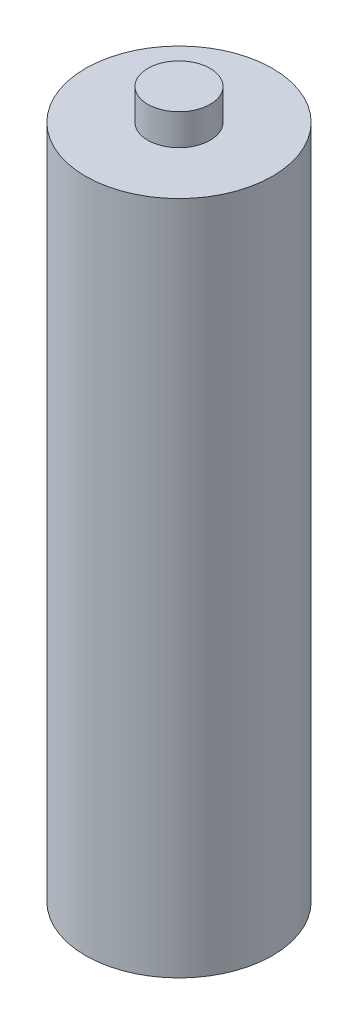
ISO-10303-21;
HEADER;
FILE_DESCRIPTION(('STEP AP214'),'2;1');
FILE_NAME('part.step','',(''),(''),'','','');
FILE_SCHEMA(('AUTOMOTIVE_DESIGN { 1 0 10303 214 1 1 1 1 }'));
ENDSEC;
DATA;
#1=APPLICATION_CONTEXT('core data for automotive mechanical design processes');
#2=APPLICATION_PROTOCOL_DEFINITION('international standard','automotive_design',2000,#1);
#3=PRODUCT_CONTEXT('',#1,'mechanical');
#4=PRODUCT('Part','Part','',(#3));
#5=PRODUCT_RELATED_PRODUCT_CATEGORY('part','',(#4));
#6=PRODUCT_DEFINITION_FORMATION('','',#4);
#7=PRODUCT_DEFINITION_CONTEXT('part definition',#1,'design');
#8=PRODUCT_DEFINITION('design','',#6,#7);
#9=PRODUCT_DEFINITION_SHAPE('','',#8);
#10=(LENGTH_UNIT() NAMED_UNIT(*) SI_UNIT(.MILLI.,.METRE.));
#11=(NAMED_UNIT(*) PLANE_ANGLE_UNIT() SI_UNIT($,.RADIAN.));
#12=(NAMED_UNIT(*) SI_UNIT($,.STERADIAN.) SOLID_ANGLE_UNIT());
#13=UNCERTAINTY_MEASURE_WITH_UNIT(LENGTH_MEASURE(1.E-05),#10,'distance_accuracy_value','');
#14=(GEOMETRIC_REPRESENTATION_CONTEXT(3) GLOBAL_UNCERTAINTY_ASSIGNED_CONTEXT((#13)) GLOBAL_UNIT_ASSIGNED_CONTEXT((#10,
#11,#12)) REPRESENTATION_CONTEXT('',''));
#15=CARTESIAN_POINT('',(0.,0.,0.));
#16=DIRECTION('',(0.,0.,1.));
#17=DIRECTION('',(1.,0.,0.));
#18=AXIS2_PLACEMENT_3D('',#15,#16,#17);
#19=CARTESIAN_POINT('',(0.,65.,0.));
#20=DIRECTION('',(0.,-1.,0.));
#21=DIRECTION('',(0.,0.,-1.));
#22=AXIS2_PLACEMENT_3D('',#19,#20,#21);
#23=CYLINDRICAL_SURFACE('',#22,9.);
#24=CARTESIAN_POINT('',(0.,65.,0.));
#25=DIRECTION('',(0.,1.,0.));
#26=DIRECTION('',(0.,0.,1.));
#27=AXIS2_PLACEMENT_3D('',#24,#25,#26);
#28=CIRCLE('',#27,9.);
#29=CARTESIAN_POINT('',(0.,65.,9.));
#30=VERTEX_POINT('',#29);
#31=EDGE_CURVE('E38',#30,#30,#28,.T.);
#32=ORIENTED_EDGE('',*,*,#31,.F.);
#33=EDGE_LOOP('',(#32));
#34=FACE_BOUND('',#33,.T.);
#35=CARTESIAN_POINT('',(0.,0.,0.));
#36=DIRECTION('',(0.,1.,0.));
#37=DIRECTION('',(0.,0.,1.));
#38=AXIS2_PLACEMENT_3D('',#35,#36,#37);
#39=CIRCLE('',#38,9.);
#40=CARTESIAN_POINT('',(0.,0.,9.));
#41=VERTEX_POINT('',#40);
#42=EDGE_CURVE('E34',#41,#41,#39,.T.);
#43=ORIENTED_EDGE('',*,*,#42,.T.);
#44=EDGE_LOOP('',(#43));
#45=FACE_BOUND('',#44,.T.);
#46=ADVANCED_FACE('F31',(#34,#45),#23,.T.);
#47=CARTESIAN_POINT('',(0.,65.,0.));
#48=DIRECTION('',(0.,1.,0.));
#49=DIRECTION('',(0.,0.,1.));
#50=AXIS2_PLACEMENT_3D('',#47,#48,#49);
#51=PLANE('',#50);
#52=CARTESIAN_POINT('',(0.,65.,0.));
#53=DIRECTION('',(0.,1.,0.));
#54=DIRECTION('',(0.,0.,1.));
#55=AXIS2_PLACEMENT_3D('',#52,#53,#54);
#56=CIRCLE('',#55,3.);
#57=CARTESIAN_POINT('',(0.,65.,3.));
#58=VERTEX_POINT('',#57);
#59=EDGE_CURVE('E10',#58,#58,#56,.T.);
#60=ORIENTED_EDGE('',*,*,#59,.F.);
#61=EDGE_LOOP('',(#60));
#62=FACE_BOUND('',#61,.T.);
#63=ORIENTED_EDGE('',*,*,#31,.T.);
#64=EDGE_LOOP('',(#63));
#65=FACE_BOUND('',#64,.T.);
#66=ADVANCED_FACE('F55',(#62,#65),#51,.T.);
#67=CARTESIAN_POINT('',(0.,0.,0.));
#68=DIRECTION('',(0.,1.,0.));
#69=DIRECTION('',(0.,0.,1.));
#70=AXIS2_PLACEMENT_3D('',#67,#68,#69);
#71=PLANE('',#70);
#72=ORIENTED_EDGE('',*,*,#42,.F.);
#73=EDGE_LOOP('',(#72));
#74=FACE_BOUND('',#73,.T.);
#75=ADVANCED_FACE('F52',(#74),#71,.F.);
#76=CARTESIAN_POINT('',(0.,68.,0.));
#77=DIRECTION('',(0.,-1.,0.));
#78=DIRECTION('',(0.,0.,-1.));
#79=AXIS2_PLACEMENT_3D('',#76,#77,#78);
#80=CYLINDRICAL_SURFACE('',#79,3.);
#81=CARTESIAN_POINT('',(0.,68.,0.));
#82=DIRECTION('',(0.,1.,0.));
#83=DIRECTION('',(0.,0.,1.));
#84=AXIS2_PLACEMENT_3D('',#81,#82,#83);
#85=CIRCLE('',#84,3.);
#86=CARTESIAN_POINT('',(0.,68.,3.));
#87=VERTEX_POINT('',#86);
#88=EDGE_CURVE('E44',#87,#87,#85,.T.);
#89=ORIENTED_EDGE('',*,*,#88,.F.);
#90=EDGE_LOOP('',(#89));
#91=FACE_BOUND('',#90,.T.);
#92=ORIENTED_EDGE('',*,*,#59,.T.);
#93=EDGE_LOOP('',(#92));
#94=FACE_BOUND('',#93,.T.);
#95=ADVANCED_FACE('F54',(#91,#94),#80,.T.);
#96=CARTESIAN_POINT('',(0.,68.,0.));
#97=DIRECTION('',(0.,1.,0.));
#98=DIRECTION('',(0.,0.,1.));
#99=AXIS2_PLACEMENT_3D('',#96,#97,#98);
#100=PLANE('',#99);
#101=ORIENTED_EDGE('',*,*,#88,.T.);
#102=EDGE_LOOP('',(#101));
#103=FACE_BOUND('',#102,.T.);
#104=ADVANCED_FACE('F60',(#103),#100,.T.);
#105=CLOSED_SHELL('',(#46,#66,#75,#95,#104));
#106=MANIFOLD_SOLID_BREP('B2',#105);
#107=ADVANCED_BREP_SHAPE_REPRESENTATION('',(#18,#106),#14);
#108=SHAPE_DEFINITION_REPRESENTATION(#9,#107);
ENDSEC;
END-ISO-10303-21;
